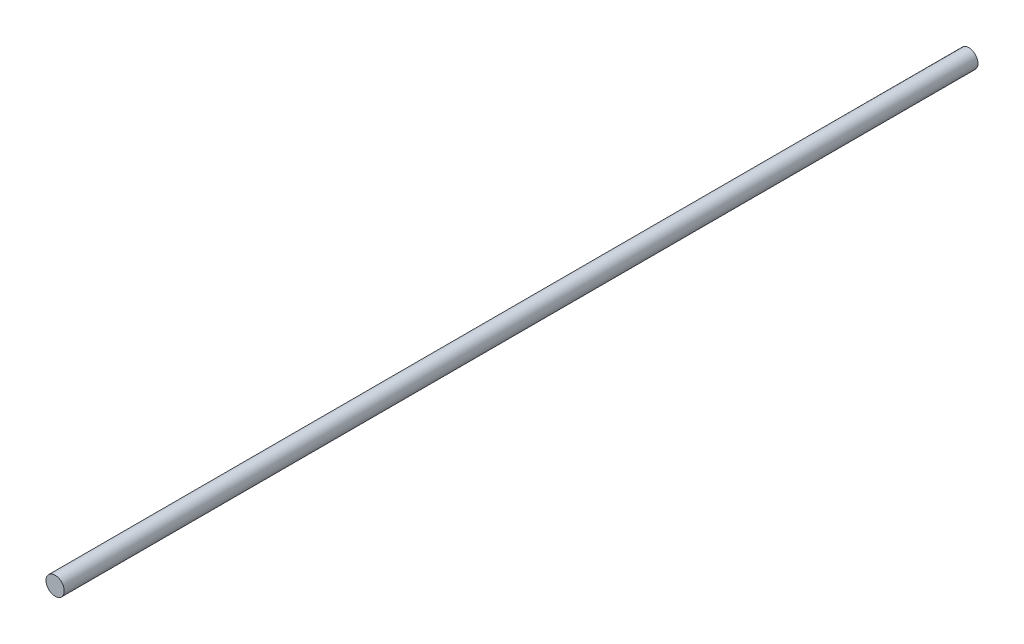
ISO-10303-21;
HEADER;
FILE_DESCRIPTION(('STEP AP214'),'2;1');
FILE_NAME('part.step','',(''),(''),'','','');
FILE_SCHEMA(('AUTOMOTIVE_DESIGN { 1 0 10303 214 1 1 1 1 }'));
ENDSEC;
DATA;
#1=APPLICATION_CONTEXT('core data for automotive mechanical design processes');
#2=APPLICATION_PROTOCOL_DEFINITION('international standard','automotive_design',2000,#1);
#3=PRODUCT_CONTEXT('',#1,'mechanical');
#4=PRODUCT('Part','Part','',(#3));
#5=PRODUCT_RELATED_PRODUCT_CATEGORY('part','',(#4));
#6=PRODUCT_DEFINITION_FORMATION('','',#4);
#7=PRODUCT_DEFINITION_CONTEXT('part definition',#1,'design');
#8=PRODUCT_DEFINITION('design','',#6,#7);
#9=PRODUCT_DEFINITION_SHAPE('','',#8);
#10=(LENGTH_UNIT() NAMED_UNIT(*) SI_UNIT(.MILLI.,.METRE.));
#11=(NAMED_UNIT(*) PLANE_ANGLE_UNIT() SI_UNIT($,.RADIAN.));
#12=(NAMED_UNIT(*) SI_UNIT($,.STERADIAN.) SOLID_ANGLE_UNIT());
#13=UNCERTAINTY_MEASURE_WITH_UNIT(LENGTH_MEASURE(1.E-05),#10,'distance_accuracy_value','');
#14=(GEOMETRIC_REPRESENTATION_CONTEXT(3) GLOBAL_UNCERTAINTY_ASSIGNED_CONTEXT((#13)) GLOBAL_UNIT_ASSIGNED_CONTEXT((#10,
#11,#12)) REPRESENTATION_CONTEXT('',''));
#15=CARTESIAN_POINT('',(0.,0.,0.));
#16=DIRECTION('',(0.,0.,1.));
#17=DIRECTION('',(1.,0.,0.));
#18=AXIS2_PLACEMENT_3D('',#15,#16,#17);
#19=CARTESIAN_POINT('',(0.,0.,200.));
#20=DIRECTION('',(0.,0.,-1.));
#21=DIRECTION('',(-1.,0.,0.));
#22=AXIS2_PLACEMENT_3D('',#19,#20,#21);
#23=CYLINDRICAL_SURFACE('',#22,4.);
#24=CARTESIAN_POINT('',(0.,0.,200.));
#25=DIRECTION('',(0.,0.,1.));
#26=DIRECTION('',(1.,0.,0.));
#27=AXIS2_PLACEMENT_3D('',#24,#25,#26);
#28=CIRCLE('',#27,4.);
#29=CARTESIAN_POINT('',(4.,0.,200.));
#30=VERTEX_POINT('',#29);
#31=EDGE_CURVE('E10',#30,#30,#28,.T.);
#32=ORIENTED_EDGE('',*,*,#31,.F.);
#33=EDGE_LOOP('',(#32));
#34=FACE_BOUND('',#33,.T.);
#35=CARTESIAN_POINT('',(0.,0.,-200.));
#36=DIRECTION('',(0.,0.,1.));
#37=DIRECTION('',(1.,0.,0.));
#38=AXIS2_PLACEMENT_3D('',#35,#36,#37);
#39=CIRCLE('',#38,4.);
#40=CARTESIAN_POINT('',(4.,0.,-200.));
#41=VERTEX_POINT('',#40);
#42=EDGE_CURVE('E33',#41,#41,#39,.T.);
#43=ORIENTED_EDGE('',*,*,#42,.T.);
#44=EDGE_LOOP('',(#43));
#45=FACE_BOUND('',#44,.T.);
#46=ADVANCED_FACE('F30',(#34,#45),#23,.T.);
#47=CARTESIAN_POINT('',(0.,0.,200.));
#48=DIRECTION('',(0.,0.,1.));
#49=DIRECTION('',(1.,0.,0.));
#50=AXIS2_PLACEMENT_3D('',#47,#48,#49);
#51=PLANE('',#50);
#52=ORIENTED_EDGE('',*,*,#31,.T.);
#53=EDGE_LOOP('',(#52));
#54=FACE_BOUND('',#53,.T.);
#55=ADVANCED_FACE('F45',(#54),#51,.T.);
#56=CARTESIAN_POINT('',(0.,0.,-200.));
#57=DIRECTION('',(0.,0.,1.));
#58=DIRECTION('',(1.,0.,0.));
#59=AXIS2_PLACEMENT_3D('',#56,#57,#58);
#60=PLANE('',#59);
#61=ORIENTED_EDGE('',*,*,#42,.F.);
#62=EDGE_LOOP('',(#61));
#63=FACE_BOUND('',#62,.T.);
#64=ADVANCED_FACE('F43',(#63),#60,.F.);
#65=CLOSED_SHELL('',(#46,#55,#64));
#66=MANIFOLD_SOLID_BREP('B2',#65);
#67=ADVANCED_BREP_SHAPE_REPRESENTATION('',(#18,#66),#14);
#68=SHAPE_DEFINITION_REPRESENTATION(#9,#67);
ENDSEC;
END-ISO-10303-21;
